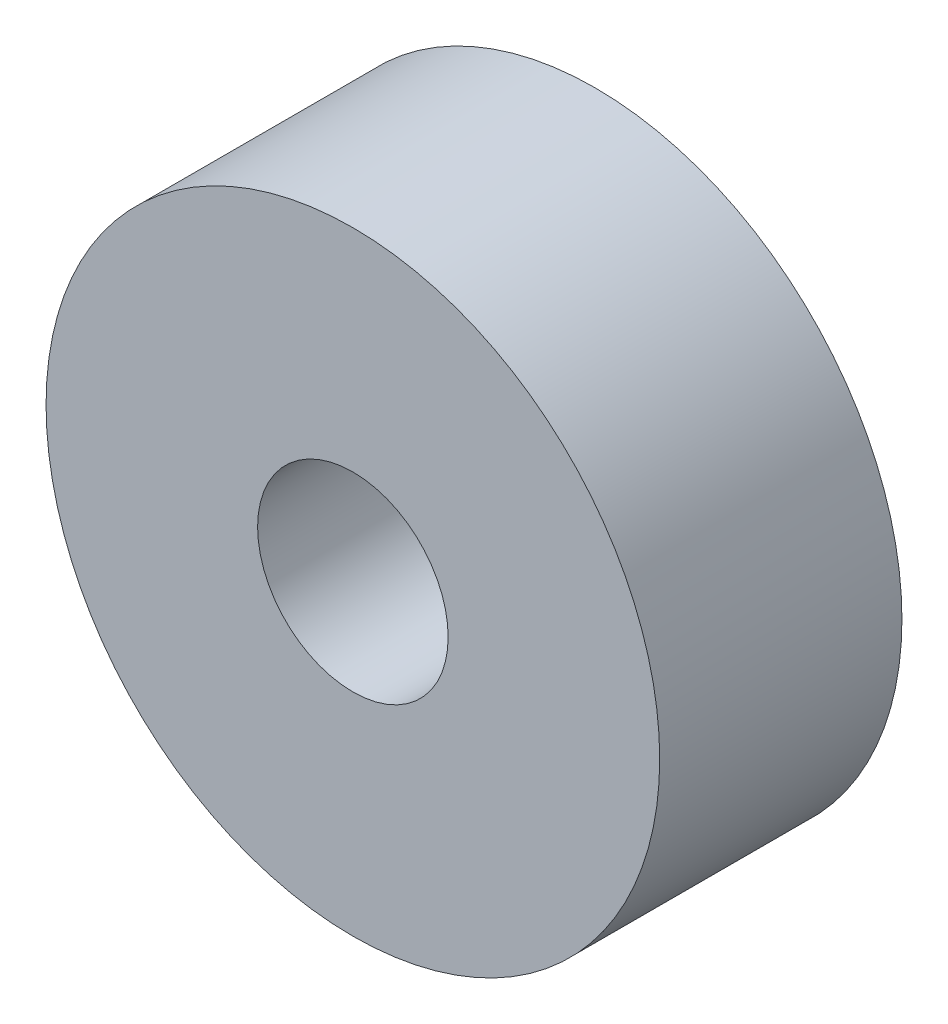
ISO-10303-21;
HEADER;
FILE_DESCRIPTION(('STEP AP214'),'2;1');
FILE_NAME('part.step','',(''),(''),'','','');
FILE_SCHEMA(('AUTOMOTIVE_DESIGN { 1 0 10303 214 1 1 1 1 }'));
ENDSEC;
DATA;
#1=APPLICATION_CONTEXT('core data for automotive mechanical design processes');
#2=APPLICATION_PROTOCOL_DEFINITION('international standard','automotive_design',2000,#1);
#3=PRODUCT_CONTEXT('',#1,'mechanical');
#4=PRODUCT('Part','Part','',(#3));
#5=PRODUCT_RELATED_PRODUCT_CATEGORY('part','',(#4));
#6=PRODUCT_DEFINITION_FORMATION('','',#4);
#7=PRODUCT_DEFINITION_CONTEXT('part definition',#1,'design');
#8=PRODUCT_DEFINITION('design','',#6,#7);
#9=PRODUCT_DEFINITION_SHAPE('','',#8);
#10=(LENGTH_UNIT() NAMED_UNIT(*) SI_UNIT(.MILLI.,.METRE.));
#11=(NAMED_UNIT(*) PLANE_ANGLE_UNIT() SI_UNIT($,.RADIAN.));
#12=(NAMED_UNIT(*) SI_UNIT($,.STERADIAN.) SOLID_ANGLE_UNIT());
#13=UNCERTAINTY_MEASURE_WITH_UNIT(LENGTH_MEASURE(1.E-05),#10,'distance_accuracy_value','');
#14=(GEOMETRIC_REPRESENTATION_CONTEXT(3) GLOBAL_UNCERTAINTY_ASSIGNED_CONTEXT((#13)) GLOBAL_UNIT_ASSIGNED_CONTEXT((#10,
#11,#12)) REPRESENTATION_CONTEXT('',''));
#15=CARTESIAN_POINT('',(0.,0.,0.));
#16=DIRECTION('',(0.,0.,1.));
#17=DIRECTION('',(1.,0.,0.));
#18=AXIS2_PLACEMENT_3D('',#15,#16,#17);
#19=CARTESIAN_POINT('',(0.,0.,7.5));
#20=DIRECTION('',(0.,0.,-1.));
#21=DIRECTION('',(-1.,0.,0.));
#22=AXIS2_PLACEMENT_3D('',#19,#20,#21);
#23=CYLINDRICAL_SURFACE('',#22,9.5);
#24=CARTESIAN_POINT('',(0.,0.,7.5));
#25=DIRECTION('',(0.,0.,1.));
#26=DIRECTION('',(1.,0.,0.));
#27=AXIS2_PLACEMENT_3D('',#24,#25,#26);
#28=CIRCLE('',#27,9.5);
#29=CARTESIAN_POINT('',(9.5,0.,7.5));
#30=VERTEX_POINT('',#29);
#31=EDGE_CURVE('E10',#30,#30,#28,.T.);
#32=ORIENTED_EDGE('',*,*,#31,.F.);
#33=EDGE_LOOP('',(#32));
#34=FACE_BOUND('',#33,.T.);
#35=CARTESIAN_POINT('',(0.,0.,0.));
#36=DIRECTION('',(0.,0.,1.));
#37=DIRECTION('',(1.,0.,0.));
#38=AXIS2_PLACEMENT_3D('',#35,#36,#37);
#39=CIRCLE('',#38,9.5);
#40=CARTESIAN_POINT('',(9.5,0.,0.));
#41=VERTEX_POINT('',#40);
#42=EDGE_CURVE('E38',#41,#41,#39,.T.);
#43=ORIENTED_EDGE('',*,*,#42,.T.);
#44=EDGE_LOOP('',(#43));
#45=FACE_BOUND('',#44,.T.);
#46=ADVANCED_FACE('F31',(#34,#45),#23,.T.);
#47=CARTESIAN_POINT('',(0.,0.,7.5));
#48=DIRECTION('',(0.,0.,1.));
#49=DIRECTION('',(1.,0.,0.));
#50=AXIS2_PLACEMENT_3D('',#47,#48,#49);
#51=PLANE('',#50);
#52=CARTESIAN_POINT('',(0.,0.,7.5));
#53=DIRECTION('',(0.,0.,1.));
#54=DIRECTION('',(1.,0.,0.));
#55=AXIS2_PLACEMENT_3D('',#52,#53,#54);
#56=CIRCLE('',#55,2.95);
#57=CARTESIAN_POINT('',(2.95,0.,7.5));
#58=VERTEX_POINT('',#57);
#59=EDGE_CURVE('E44',#58,#58,#56,.T.);
#60=ORIENTED_EDGE('',*,*,#59,.F.);
#61=EDGE_LOOP('',(#60));
#62=FACE_BOUND('',#61,.T.);
#63=ORIENTED_EDGE('',*,*,#31,.T.);
#64=EDGE_LOOP('',(#63));
#65=FACE_BOUND('',#64,.T.);
#66=ADVANCED_FACE('F60',(#62,#65),#51,.T.);
#67=CARTESIAN_POINT('',(0.,0.,0.));
#68=DIRECTION('',(0.,0.,1.));
#69=DIRECTION('',(1.,0.,0.));
#70=AXIS2_PLACEMENT_3D('',#67,#68,#69);
#71=PLANE('',#70);
#72=CARTESIAN_POINT('',(0.,0.,0.));
#73=DIRECTION('',(0.,0.,1.));
#74=DIRECTION('',(1.,0.,0.));
#75=AXIS2_PLACEMENT_3D('',#72,#73,#74);
#76=CIRCLE('',#75,2.95);
#77=CARTESIAN_POINT('',(2.95,0.,0.));
#78=VERTEX_POINT('',#77);
#79=EDGE_CURVE('E34',#78,#78,#76,.T.);
#80=ORIENTED_EDGE('',*,*,#79,.T.);
#81=EDGE_LOOP('',(#80));
#82=FACE_BOUND('',#81,.T.);
#83=ORIENTED_EDGE('',*,*,#42,.F.);
#84=EDGE_LOOP('',(#83));
#85=FACE_BOUND('',#84,.T.);
#86=ADVANCED_FACE('F51',(#82,#85),#71,.F.);
#87=CARTESIAN_POINT('',(0.,0.,-2.5));
#88=DIRECTION('',(0.,0.,1.));
#89=DIRECTION('',(1.,0.,0.));
#90=AXIS2_PLACEMENT_3D('',#87,#88,#89);
#91=CYLINDRICAL_SURFACE('',#90,2.95);
#92=ORIENTED_EDGE('',*,*,#59,.T.);
#93=EDGE_LOOP('',(#92));
#94=FACE_BOUND('',#93,.T.);
#95=ORIENTED_EDGE('',*,*,#79,.F.);
#96=EDGE_LOOP('',(#95));
#97=FACE_BOUND('',#96,.T.);
#98=ADVANCED_FACE('F54',(#94,#97),#91,.F.);
#99=CLOSED_SHELL('',(#46,#66,#86,#98));
#100=MANIFOLD_SOLID_BREP('B2',#99);
#101=ADVANCED_BREP_SHAPE_REPRESENTATION('',(#18,#100),#14);
#102=SHAPE_DEFINITION_REPRESENTATION(#9,#101);
ENDSEC;
END-ISO-10303-21;
